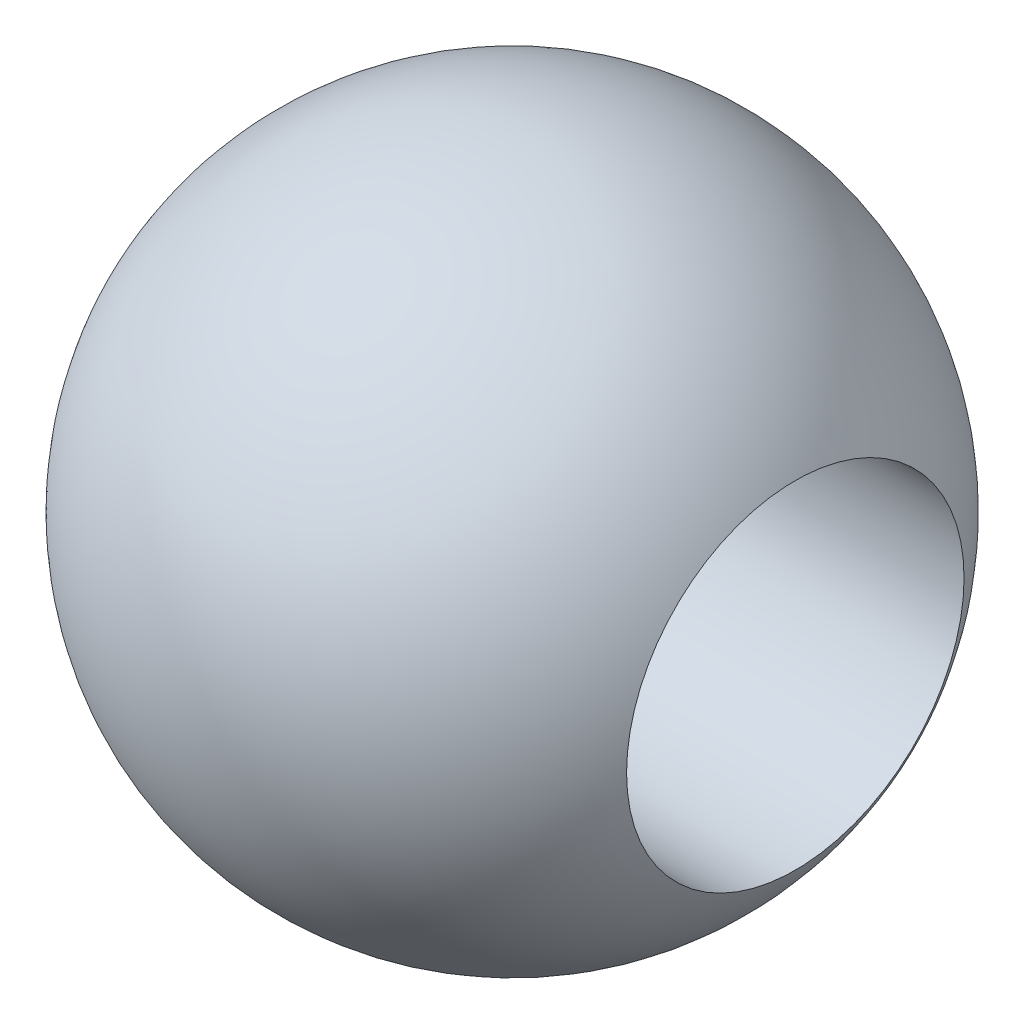
ISO-10303-21;
HEADER;
FILE_DESCRIPTION(('STEP AP214'),'2;1');
FILE_NAME('part.step','',(''),(''),'','','');
FILE_SCHEMA(('AUTOMOTIVE_DESIGN { 1 0 10303 214 1 1 1 1 }'));
ENDSEC;
DATA;
#1=APPLICATION_CONTEXT('core data for automotive mechanical design processes');
#2=APPLICATION_PROTOCOL_DEFINITION('international standard','automotive_design',2000,#1);
#3=PRODUCT_CONTEXT('',#1,'mechanical');
#4=PRODUCT('Part','Part','',(#3));
#5=PRODUCT_RELATED_PRODUCT_CATEGORY('part','',(#4));
#6=PRODUCT_DEFINITION_FORMATION('','',#4);
#7=PRODUCT_DEFINITION_CONTEXT('part definition',#1,'design');
#8=PRODUCT_DEFINITION('design','',#6,#7);
#9=PRODUCT_DEFINITION_SHAPE('','',#8);
#10=(LENGTH_UNIT() NAMED_UNIT(*) SI_UNIT(.MILLI.,.METRE.));
#11=(NAMED_UNIT(*) PLANE_ANGLE_UNIT() SI_UNIT($,.RADIAN.));
#12=(NAMED_UNIT(*) SI_UNIT($,.STERADIAN.) SOLID_ANGLE_UNIT());
#13=UNCERTAINTY_MEASURE_WITH_UNIT(LENGTH_MEASURE(1.E-05),#10,'distance_accuracy_value','');
#14=(GEOMETRIC_REPRESENTATION_CONTEXT(3) GLOBAL_UNCERTAINTY_ASSIGNED_CONTEXT((#13)) GLOBAL_UNIT_ASSIGNED_CONTEXT((#10,
#11,#12)) REPRESENTATION_CONTEXT('',''));
#15=CARTESIAN_POINT('',(0.,0.,0.));
#16=DIRECTION('',(0.,0.,1.));
#17=DIRECTION('',(1.,0.,0.));
#18=AXIS2_PLACEMENT_3D('',#15,#16,#17);
#19=CARTESIAN_POINT('',(0.,0.,0.));
#20=DIRECTION('',(0.,1.,0.));
#21=DIRECTION('',(1.,0.,0.));
#22=AXIS2_PLACEMENT_3D('',#19,#20,#21);
#23=SPHERICAL_SURFACE('',#22,2.93);
#24=CARTESIAN_POINT('',(0.,0.,0.));
#25=DIRECTION('',(-1.,0.,0.));
#26=DIRECTION('',(0.,0.,1.));
#27=AXIS2_PLACEMENT_3D('',#24,#25,#26);
#28=SPHERICAL_SURFACE('',#27,2.93);
#29=CARTESIAN_POINT('',(2.51692272428058,0.,0.));
#30=DIRECTION('',(-1.,0.,0.));
#31=DIRECTION('',(0.,0.,1.));
#32=AXIS2_PLACEMENT_3D('',#29,#30,#31);
#33=CIRCLE('',#32,1.5);
#34=CARTESIAN_POINT('',(2.51692272428058,0.,1.5));
#35=VERTEX_POINT('',#34);
#36=EDGE_CURVE('E10',#35,#35,#33,.T.);
#37=ORIENTED_EDGE('',*,*,#36,.T.);
#38=EDGE_LOOP('',(#37));
#39=FACE_BOUND('',#38,.T.);
#40=CARTESIAN_POINT('',(-2.51692272428058,0.,0.));
#41=DIRECTION('',(1.,0.,0.));
#42=DIRECTION('',(0.,0.,-1.));
#43=AXIS2_PLACEMENT_3D('',#40,#41,#42);
#44=CIRCLE('',#43,1.5);
#45=CARTESIAN_POINT('',(-2.51692272428058,0.,-1.5));
#46=VERTEX_POINT('',#45);
#47=EDGE_CURVE('E45',#46,#46,#44,.T.);
#48=ORIENTED_EDGE('',*,*,#47,.T.);
#49=EDGE_LOOP('',(#48));
#50=FACE_BOUND('',#49,.T.);
#51=ADVANCED_FACE('F39',(#39,#50),#28,.T.);
#52=CARTESIAN_POINT('',(-2.93,0.,0.));
#53=DIRECTION('',(1.,0.,0.));
#54=DIRECTION('',(0.,0.,-1.));
#55=AXIS2_PLACEMENT_3D('',#52,#53,#54);
#56=CYLINDRICAL_SURFACE('',#55,1.5);
#57=ORIENTED_EDGE('',*,*,#47,.F.);
#58=EDGE_LOOP('',(#57));
#59=FACE_BOUND('',#58,.T.);
#60=ORIENTED_EDGE('',*,*,#36,.F.);
#61=EDGE_LOOP('',(#60));
#62=FACE_BOUND('',#61,.T.);
#63=ADVANCED_FACE('F52',(#59,#62),#56,.F.);
#64=CLOSED_SHELL('',(#51,#63));
#65=MANIFOLD_SOLID_BREP('B2',#64);
#66=ADVANCED_BREP_SHAPE_REPRESENTATION('',(#18,#65),#14);
#67=SHAPE_DEFINITION_REPRESENTATION(#9,#66);
ENDSEC;
END-ISO-10303-21;
